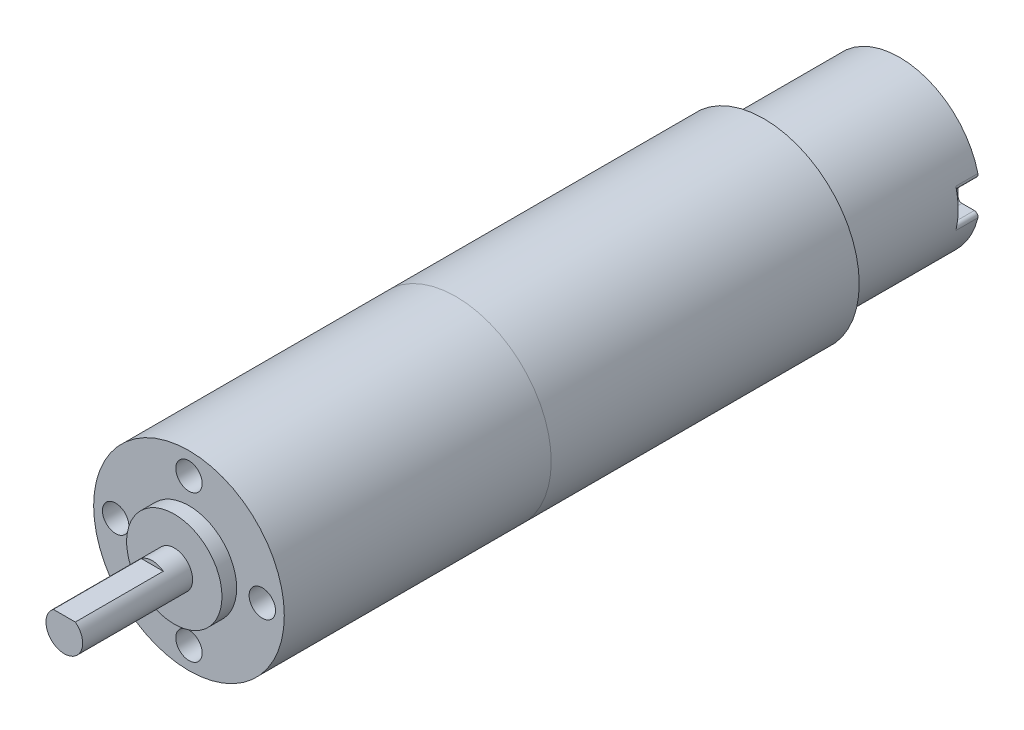
ISO-10303-21;
HEADER;
FILE_DESCRIPTION(('STEP AP214'),'2;1');
FILE_NAME('part.step','',(''),(''),'','','');
FILE_SCHEMA(('AUTOMOTIVE_DESIGN { 1 0 10303 214 1 1 1 1 }'));
ENDSEC;
DATA;
#1=APPLICATION_CONTEXT('core data for automotive mechanical design processes');
#2=APPLICATION_PROTOCOL_DEFINITION('international standard','automotive_design',2000,#1);
#3=PRODUCT_CONTEXT('',#1,'mechanical');
#4=PRODUCT('Part','Part','',(#3));
#5=PRODUCT_RELATED_PRODUCT_CATEGORY('part','',(#4));
#6=PRODUCT_DEFINITION_FORMATION('','',#4);
#7=PRODUCT_DEFINITION_CONTEXT('part definition',#1,'design');
#8=PRODUCT_DEFINITION('design','',#6,#7);
#9=PRODUCT_DEFINITION_SHAPE('','',#8);
#10=(LENGTH_UNIT() NAMED_UNIT(*) SI_UNIT(.MILLI.,.METRE.));
#11=(NAMED_UNIT(*) PLANE_ANGLE_UNIT() SI_UNIT($,.RADIAN.));
#12=(NAMED_UNIT(*) SI_UNIT($,.STERADIAN.) SOLID_ANGLE_UNIT());
#13=UNCERTAINTY_MEASURE_WITH_UNIT(LENGTH_MEASURE(1.E-05),#10,'distance_accuracy_value','');
#14=(GEOMETRIC_REPRESENTATION_CONTEXT(3) GLOBAL_UNCERTAINTY_ASSIGNED_CONTEXT((#13)) GLOBAL_UNIT_ASSIGNED_CONTEXT((#10,
#11,#12)) REPRESENTATION_CONTEXT('',''));
#15=CARTESIAN_POINT('',(0.,0.,0.));
#16=DIRECTION('',(0.,0.,1.));
#17=DIRECTION('',(1.,0.,0.));
#18=AXIS2_PLACEMENT_3D('',#15,#16,#17);
#19=CARTESIAN_POINT('',(0.,0.,-60.5));
#20=DIRECTION('',(0.,0.,1.));
#21=DIRECTION('',(1.,0.,0.));
#22=AXIS2_PLACEMENT_3D('',#19,#20,#21);
#23=CYLINDRICAL_SURFACE('',#22,11.);
#24=CARTESIAN_POINT('',(0.,0.,-56.5));
#25=DIRECTION('',(0.,0.,-1.));
#26=DIRECTION('',(-1.,0.,0.));
#27=AXIS2_PLACEMENT_3D('',#24,#25,#26);
#28=CIRCLE('',#27,11.);
#29=CARTESIAN_POINT('',(7.69839633446142,-7.85714285714285,-56.5));
#30=VERTEX_POINT('',#29);
#31=CARTESIAN_POINT('',(-7.69839633446141,-7.85714285714286,-56.5));
#32=VERTEX_POINT('',#31);
#33=EDGE_CURVE('E320',#30,#32,#28,.T.);
#34=ORIENTED_EDGE('',*,*,#33,.F.);
#35=DIRECTION('',(0.,0.,1.));
#36=VECTOR('',#35,1.);
#37=CARTESIAN_POINT('',(7.69839633446142,-7.85714285714285,-60.5));
#38=LINE('',#37,#36);
#39=CARTESIAN_POINT('',(7.69839633446142,-7.85714285714285,-60.5));
#40=VERTEX_POINT('',#39);
#41=EDGE_CURVE('E223',#30,#40,#38,.F.);
#42=ORIENTED_EDGE('',*,*,#41,.T.);
#43=CARTESIAN_POINT('',(0.,0.,-60.5));
#44=DIRECTION('',(0.,0.,-1.));
#45=DIRECTION('',(-1.,0.,0.));
#46=AXIS2_PLACEMENT_3D('',#43,#44,#45);
#47=CIRCLE('',#46,11.);
#48=CARTESIAN_POINT('',(10.683659933242,-2.61904761904762,-60.5));
#49=VERTEX_POINT('',#48);
#50=EDGE_CURVE('E220',#49,#40,#47,.T.);
#51=ORIENTED_EDGE('',*,*,#50,.F.);
#52=DIRECTION('',(0.,0.,1.));
#53=VECTOR('',#52,1.);
#54=CARTESIAN_POINT('',(10.683659933242,-2.61904761904762,-60.5));
#55=LINE('',#54,#53);
#56=CARTESIAN_POINT('',(10.683659933242,-2.61904761904762,-57.5));
#57=VERTEX_POINT('',#56);
#58=EDGE_CURVE('E316',#49,#57,#55,.T.);
#59=ORIENTED_EDGE('',*,*,#58,.T.);
#60=CARTESIAN_POINT('',(0.,0.,-57.5));
#61=DIRECTION('',(0.,0.,-1.));
#62=DIRECTION('',(-1.,0.,0.));
#63=AXIS2_PLACEMENT_3D('',#60,#61,#62);
#64=CIRCLE('',#63,11.);
#65=CARTESIAN_POINT('',(10.683659933242,2.61904761904762,-57.5));
#66=VERTEX_POINT('',#65);
#67=EDGE_CURVE('E302',#66,#57,#64,.T.);
#68=ORIENTED_EDGE('',*,*,#67,.F.);
#69=DIRECTION('',(0.,0.,1.));
#70=VECTOR('',#69,1.);
#71=CARTESIAN_POINT('',(10.683659933242,2.61904761904762,-60.5));
#72=LINE('',#71,#70);
#73=CARTESIAN_POINT('',(10.683659933242,2.61904761904762,-60.5));
#74=VERTEX_POINT('',#73);
#75=EDGE_CURVE('E329',#66,#74,#72,.F.);
#76=ORIENTED_EDGE('',*,*,#75,.T.);
#77=CARTESIAN_POINT('',(-10.683659933242,2.61904761904762,-60.5));
#78=VERTEX_POINT('',#77);
#79=EDGE_CURVE('E218',#78,#74,#47,.T.);
#80=ORIENTED_EDGE('',*,*,#79,.F.);
#81=DIRECTION('',(0.,0.,1.));
#82=VECTOR('',#81,1.);
#83=CARTESIAN_POINT('',(-10.683659933242,2.61904761904762,-60.5));
#84=LINE('',#83,#82);
#85=CARTESIAN_POINT('',(-10.683659933242,2.61904761904762,-57.5));
#86=VERTEX_POINT('',#85);
#87=EDGE_CURVE('E224',#78,#86,#84,.T.);
#88=ORIENTED_EDGE('',*,*,#87,.T.);
#89=CARTESIAN_POINT('',(0.,0.,-57.5));
#90=DIRECTION('',(0.,0.,1.));
#91=DIRECTION('',(1.,0.,0.));
#92=AXIS2_PLACEMENT_3D('',#89,#90,#91);
#93=CIRCLE('',#92,11.);
#94=CARTESIAN_POINT('',(-10.683659933242,-2.61904761904762,-57.5));
#95=VERTEX_POINT('',#94);
#96=EDGE_CURVE('E359',#86,#95,#93,.T.);
#97=ORIENTED_EDGE('',*,*,#96,.T.);
#98=DIRECTION('',(0.,0.,1.));
#99=VECTOR('',#98,1.);
#100=CARTESIAN_POINT('',(-10.683659933242,-2.61904761904762,-60.5));
#101=LINE('',#100,#99);
#102=CARTESIAN_POINT('',(-10.683659933242,-2.61904761904762,-60.5));
#103=VERTEX_POINT('',#102);
#104=EDGE_CURVE('E216',#95,#103,#101,.F.);
#105=ORIENTED_EDGE('',*,*,#104,.T.);
#106=CARTESIAN_POINT('',(-7.69839633446141,-7.85714285714286,-60.5));
#107=VERTEX_POINT('',#106);
#108=EDGE_CURVE('E199',#107,#103,#47,.T.);
#109=ORIENTED_EDGE('',*,*,#108,.F.);
#110=DIRECTION('',(0.,0.,1.));
#111=VECTOR('',#110,1.);
#112=CARTESIAN_POINT('',(-7.69839633446141,-7.85714285714286,-60.5));
#113=LINE('',#112,#111);
#114=EDGE_CURVE('E213',#107,#32,#113,.T.);
#115=ORIENTED_EDGE('',*,*,#114,.T.);
#116=EDGE_LOOP('',(#34,#42,#51,#59,#68,#76,#80,#88,#97,#105,#109,#115));
#117=FACE_BOUND('',#116,.T.);
#118=CARTESIAN_POINT('',(0.,0.,-42.));
#119=DIRECTION('',(0.,0.,-1.));
#120=DIRECTION('',(-1.,0.,0.));
#121=AXIS2_PLACEMENT_3D('',#118,#119,#120);
#122=CIRCLE('',#121,11.);
#123=CARTESIAN_POINT('',(-11.,0.,-42.));
#124=VERTEX_POINT('',#123);
#125=EDGE_CURVE('E326',#124,#124,#122,.T.);
#126=ORIENTED_EDGE('',*,*,#125,.T.);
#127=EDGE_LOOP('',(#126));
#128=FACE_BOUND('',#127,.T.);
#129=ADVANCED_FACE('F56',(#117,#128),#23,.T.);
#130=CARTESIAN_POINT('',(0.,0.,-60.5));
#131=DIRECTION('',(0.,0.,-1.));
#132=DIRECTION('',(-1.,0.,0.));
#133=AXIS2_PLACEMENT_3D('',#130,#131,#132);
#134=PLANE('',#133);
#135=ORIENTED_EDGE('',*,*,#50,.T.);
#136=CARTESIAN_POINT('',(7.34846922834954,-7.5,-60.5));
#137=DIRECTION('',(0.,0.,-1.));
#138=DIRECTION('',(-1.,0.,0.));
#139=AXIS2_PLACEMENT_3D('',#136,#137,#138);
#140=CIRCLE('',#139,0.5);
#141=CARTESIAN_POINT('',(7.34846922834954,-8.,-60.5));
#142=VERTEX_POINT('',#141);
#143=EDGE_CURVE('E206',#40,#142,#140,.T.);
#144=ORIENTED_EDGE('',*,*,#143,.T.);
#145=DIRECTION('',(-1.,0.,0.));
#146=VECTOR('',#145,1.);
#147=CARTESIAN_POINT('',(0.,-8.,-60.5));
#148=LINE('',#147,#146);
#149=CARTESIAN_POINT('',(-7.34846922834953,-8.,-60.5));
#150=VERTEX_POINT('',#149);
#151=EDGE_CURVE('E201',#142,#150,#148,.T.);
#152=ORIENTED_EDGE('',*,*,#151,.T.);
#153=CARTESIAN_POINT('',(-7.34846922834953,-7.5,-60.5));
#154=DIRECTION('',(0.,0.,-1.));
#155=DIRECTION('',(-1.,0.,0.));
#156=AXIS2_PLACEMENT_3D('',#153,#154,#155);
#157=CIRCLE('',#156,0.5);
#158=EDGE_CURVE('E195',#150,#107,#157,.T.);
#159=ORIENTED_EDGE('',*,*,#158,.T.);
#160=ORIENTED_EDGE('',*,*,#108,.T.);
#161=CARTESIAN_POINT('',(-10.1980390271856,-2.5,-60.5));
#162=DIRECTION('',(0.,0.,-1.));
#163=DIRECTION('',(-1.,0.,0.));
#164=AXIS2_PLACEMENT_3D('',#161,#162,#163);
#165=CIRCLE('',#164,0.5);
#166=CARTESIAN_POINT('',(-10.1980390271856,-2.,-60.5));
#167=VERTEX_POINT('',#166);
#168=EDGE_CURVE('E236',#103,#167,#165,.T.);
#169=ORIENTED_EDGE('',*,*,#168,.T.);
#170=DIRECTION('',(-1.,0.,0.));
#171=VECTOR('',#170,1.);
#172=CARTESIAN_POINT('',(0.,-2.,-60.5));
#173=LINE('',#172,#171);
#174=CARTESIAN_POINT('',(-8.5,-2.,-60.5));
#175=VERTEX_POINT('',#174);
#176=EDGE_CURVE('E367',#175,#167,#173,.T.);
#177=ORIENTED_EDGE('',*,*,#176,.F.);
#178=CARTESIAN_POINT('',(-8.5,-1.5,-60.5));
#179=DIRECTION('',(0.,0.,-1.));
#180=DIRECTION('',(-1.,0.,0.));
#181=AXIS2_PLACEMENT_3D('',#178,#179,#180);
#182=CIRCLE('',#181,0.5);
#183=CARTESIAN_POINT('',(-8.,-1.5,-60.5));
#184=VERTEX_POINT('',#183);
#185=EDGE_CURVE('E291',#175,#184,#182,.F.);
#186=ORIENTED_EDGE('',*,*,#185,.T.);
#187=DIRECTION('',(0.,-1.,0.));
#188=VECTOR('',#187,1.);
#189=CARTESIAN_POINT('',(-8.,0.,-60.5));
#190=LINE('',#189,#188);
#191=CARTESIAN_POINT('',(-8.,1.5,-60.5));
#192=VERTEX_POINT('',#191);
#193=EDGE_CURVE('E371',#192,#184,#190,.T.);
#194=ORIENTED_EDGE('',*,*,#193,.F.);
#195=CARTESIAN_POINT('',(-8.5,1.5,-60.5));
#196=DIRECTION('',(0.,0.,-1.));
#197=DIRECTION('',(-1.,0.,0.));
#198=AXIS2_PLACEMENT_3D('',#195,#196,#197);
#199=CIRCLE('',#198,0.5);
#200=CARTESIAN_POINT('',(-8.5,2.,-60.5));
#201=VERTEX_POINT('',#200);
#202=EDGE_CURVE('E289',#192,#201,#199,.F.);
#203=ORIENTED_EDGE('',*,*,#202,.T.);
#204=DIRECTION('',(-1.,0.,0.));
#205=VECTOR('',#204,1.);
#206=CARTESIAN_POINT('',(0.,2.,-60.5));
#207=LINE('',#206,#205);
#208=CARTESIAN_POINT('',(-10.1980390271856,2.,-60.5));
#209=VERTEX_POINT('',#208);
#210=EDGE_CURVE('E345',#201,#209,#207,.T.);
#211=ORIENTED_EDGE('',*,*,#210,.T.);
#212=CARTESIAN_POINT('',(-10.1980390271856,2.5,-60.5));
#213=DIRECTION('',(0.,0.,-1.));
#214=DIRECTION('',(-1.,0.,0.));
#215=AXIS2_PLACEMENT_3D('',#212,#213,#214);
#216=CIRCLE('',#215,0.5);
#217=EDGE_CURVE('E207',#209,#78,#216,.T.);
#218=ORIENTED_EDGE('',*,*,#217,.T.);
#219=ORIENTED_EDGE('',*,*,#79,.T.);
#220=CARTESIAN_POINT('',(10.1980390271856,2.5,-60.5));
#221=DIRECTION('',(0.,0.,-1.));
#222=DIRECTION('',(-1.,0.,0.));
#223=AXIS2_PLACEMENT_3D('',#220,#221,#222);
#224=CIRCLE('',#223,0.5);
#225=CARTESIAN_POINT('',(10.1980390271856,2.,-60.5));
#226=VERTEX_POINT('',#225);
#227=EDGE_CURVE('E227',#74,#226,#224,.T.);
#228=ORIENTED_EDGE('',*,*,#227,.T.);
#229=DIRECTION('',(1.,0.,0.));
#230=VECTOR('',#229,1.);
#231=CARTESIAN_POINT('',(0.,2.,-60.5));
#232=LINE('',#231,#230);
#233=CARTESIAN_POINT('',(8.5,2.,-60.5));
#234=VERTEX_POINT('',#233);
#235=EDGE_CURVE('E313',#234,#226,#232,.T.);
#236=ORIENTED_EDGE('',*,*,#235,.F.);
#237=CARTESIAN_POINT('',(8.5,1.5,-60.5));
#238=DIRECTION('',(0.,0.,-1.));
#239=DIRECTION('',(-1.,0.,0.));
#240=AXIS2_PLACEMENT_3D('',#237,#238,#239);
#241=CIRCLE('',#240,0.5);
#242=CARTESIAN_POINT('',(8.,1.5,-60.5));
#243=VERTEX_POINT('',#242);
#244=EDGE_CURVE('E295',#234,#243,#241,.F.);
#245=ORIENTED_EDGE('',*,*,#244,.T.);
#246=DIRECTION('',(0.,-1.,0.));
#247=VECTOR('',#246,1.);
#248=CARTESIAN_POINT('',(8.,0.,-60.5));
#249=LINE('',#248,#247);
#250=CARTESIAN_POINT('',(8.,-1.5,-60.5));
#251=VERTEX_POINT('',#250);
#252=EDGE_CURVE('E380',#243,#251,#249,.T.);
#253=ORIENTED_EDGE('',*,*,#252,.T.);
#254=CARTESIAN_POINT('',(8.5,-1.5,-60.5));
#255=DIRECTION('',(0.,0.,-1.));
#256=DIRECTION('',(-1.,0.,0.));
#257=AXIS2_PLACEMENT_3D('',#254,#255,#256);
#258=CIRCLE('',#257,0.5);
#259=CARTESIAN_POINT('',(8.5,-2.,-60.5));
#260=VERTEX_POINT('',#259);
#261=EDGE_CURVE('E293',#251,#260,#258,.F.);
#262=ORIENTED_EDGE('',*,*,#261,.T.);
#263=DIRECTION('',(1.,0.,0.));
#264=VECTOR('',#263,1.);
#265=CARTESIAN_POINT('',(0.,-2.,-60.5));
#266=LINE('',#265,#264);
#267=CARTESIAN_POINT('',(10.1980390271856,-2.,-60.5));
#268=VERTEX_POINT('',#267);
#269=EDGE_CURVE('E318',#260,#268,#266,.T.);
#270=ORIENTED_EDGE('',*,*,#269,.T.);
#271=CARTESIAN_POINT('',(10.1980390271856,-2.5,-60.5));
#272=DIRECTION('',(0.,0.,-1.));
#273=DIRECTION('',(-1.,0.,0.));
#274=AXIS2_PLACEMENT_3D('',#271,#272,#273);
#275=CIRCLE('',#274,0.5);
#276=EDGE_CURVE('E234',#268,#49,#275,.T.);
#277=ORIENTED_EDGE('',*,*,#276,.T.);
#278=EDGE_LOOP('',(#135,#144,#152,#159,#160,#169,#177,#186,#194,#203,#211,#218,#219,#228,#236,
#245,#253,#262,#270,#277));
#279=FACE_BOUND('',#278,.T.);
#280=ADVANCED_FACE('F198',(#279),#134,.T.);
#281=CARTESIAN_POINT('',(0.,0.,-42.));
#282=DIRECTION('',(0.,0.,1.));
#283=DIRECTION('',(1.,0.,0.));
#284=AXIS2_PLACEMENT_3D('',#281,#282,#283);
#285=CYLINDRICAL_SURFACE('',#284,13.);
#286=CARTESIAN_POINT('',(0.,0.,-42.));
#287=DIRECTION('',(0.,0.,-1.));
#288=DIRECTION('',(-1.,0.,0.));
#289=AXIS2_PLACEMENT_3D('',#286,#287,#288);
#290=CIRCLE('',#289,13.);
#291=CARTESIAN_POINT('',(-13.,0.,-42.));
#292=VERTEX_POINT('',#291);
#293=EDGE_CURVE('E330',#292,#292,#290,.T.);
#294=ORIENTED_EDGE('',*,*,#293,.F.);
#295=EDGE_LOOP('',(#294));
#296=FACE_BOUND('',#295,.T.);
#297=CARTESIAN_POINT('',(0.,0.,0.));
#298=DIRECTION('',(0.,0.,-1.));
#299=DIRECTION('',(-1.,0.,0.));
#300=AXIS2_PLACEMENT_3D('',#297,#298,#299);
#301=CIRCLE('',#300,13.);
#302=CARTESIAN_POINT('',(-13.,0.,0.));
#303=VERTEX_POINT('',#302);
#304=EDGE_CURVE('E217',#303,#303,#301,.T.);
#305=ORIENTED_EDGE('',*,*,#304,.T.);
#306=EDGE_LOOP('',(#305));
#307=FACE_BOUND('',#306,.T.);
#308=ADVANCED_FACE('F409',(#296,#307),#285,.T.);
#309=CARTESIAN_POINT('',(0.,0.,-42.));
#310=DIRECTION('',(0.,0.,-1.));
#311=DIRECTION('',(-1.,0.,0.));
#312=AXIS2_PLACEMENT_3D('',#309,#310,#311);
#313=PLANE('',#312);
#314=ORIENTED_EDGE('',*,*,#125,.F.);
#315=EDGE_LOOP('',(#314));
#316=FACE_BOUND('',#315,.T.);
#317=ORIENTED_EDGE('',*,*,#293,.T.);
#318=EDGE_LOOP('',(#317));
#319=FACE_BOUND('',#318,.T.);
#320=ADVANCED_FACE('F413',(#316,#319),#313,.T.);
#321=CARTESIAN_POINT('',(0.,0.,0.));
#322=DIRECTION('',(0.,0.,-1.));
#323=DIRECTION('',(-1.,0.,0.));
#324=AXIS2_PLACEMENT_3D('',#321,#322,#323);
#325=PLANE('',#324);
#326=ORIENTED_EDGE('',*,*,#304,.F.);
#327=EDGE_LOOP('',(#326));
#328=FACE_BOUND('',#327,.T.);
#329=ADVANCED_FACE('F416',(#328),#325,.F.);
#330=CARTESIAN_POINT('',(0.,-8.,-56.5));
#331=DIRECTION('',(0.,-1.,0.));
#332=DIRECTION('',(1.,0.,0.));
#333=AXIS2_PLACEMENT_3D('',#330,#331,#332);
#334=PLANE('',#333);
#335=ORIENTED_EDGE('',*,*,#151,.F.);
#336=DIRECTION('',(0.,0.,-1.));
#337=VECTOR('',#336,1.);
#338=CARTESIAN_POINT('',(7.34846922834954,-8.,-56.5));
#339=LINE('',#338,#337);
#340=CARTESIAN_POINT('',(7.34846922834954,-8.,-56.5));
#341=VERTEX_POINT('',#340);
#342=EDGE_CURVE('E242',#142,#341,#339,.F.);
#343=ORIENTED_EDGE('',*,*,#342,.T.);
#344=DIRECTION('',(-1.,0.,0.));
#345=VECTOR('',#344,1.);
#346=CARTESIAN_POINT('',(0.,-8.,-56.5));
#347=LINE('',#346,#345);
#348=CARTESIAN_POINT('',(-7.34846922834953,-8.,-56.5));
#349=VERTEX_POINT('',#348);
#350=EDGE_CURVE('E322',#341,#349,#347,.T.);
#351=ORIENTED_EDGE('',*,*,#350,.T.);
#352=DIRECTION('',(0.,0.,-1.));
#353=VECTOR('',#352,1.);
#354=CARTESIAN_POINT('',(-7.34846922834953,-8.,-60.5));
#355=LINE('',#354,#353);
#356=EDGE_CURVE('E240',#349,#150,#355,.T.);
#357=ORIENTED_EDGE('',*,*,#356,.T.);
#358=EDGE_LOOP('',(#335,#343,#351,#357));
#359=FACE_BOUND('',#358,.T.);
#360=ADVANCED_FACE('F387',(#359),#334,.T.);
#361=CARTESIAN_POINT('',(0.,0.,-56.5));
#362=DIRECTION('',(0.,0.,-1.));
#363=DIRECTION('',(-1.,0.,0.));
#364=AXIS2_PLACEMENT_3D('',#361,#362,#363);
#365=PLANE('',#364);
#366=ORIENTED_EDGE('',*,*,#350,.F.);
#367=CARTESIAN_POINT('',(7.34846922834954,-7.5,-56.5));
#368=DIRECTION('',(0.,0.,-1.));
#369=DIRECTION('',(-1.,0.,0.));
#370=AXIS2_PLACEMENT_3D('',#367,#368,#369);
#371=CIRCLE('',#370,0.5);
#372=EDGE_CURVE('E280',#341,#30,#371,.F.);
#373=ORIENTED_EDGE('',*,*,#372,.T.);
#374=ORIENTED_EDGE('',*,*,#33,.T.);
#375=CARTESIAN_POINT('',(-7.34846922834953,-7.5,-56.5));
#376=DIRECTION('',(0.,0.,-1.));
#377=DIRECTION('',(-1.,0.,0.));
#378=AXIS2_PLACEMENT_3D('',#375,#376,#377);
#379=CIRCLE('',#378,0.5);
#380=EDGE_CURVE('E222',#32,#349,#379,.F.);
#381=ORIENTED_EDGE('',*,*,#380,.T.);
#382=EDGE_LOOP('',(#366,#373,#374,#381));
#383=FACE_BOUND('',#382,.T.);
#384=ADVANCED_FACE('F391',(#383),#365,.T.);
#385=CARTESIAN_POINT('',(0.,-2.,-57.5));
#386=DIRECTION('',(0.,1.,0.));
#387=DIRECTION('',(0.,0.,1.));
#388=AXIS2_PLACEMENT_3D('',#385,#386,#387);
#389=PLANE('',#388);
#390=ORIENTED_EDGE('',*,*,#269,.F.);
#391=DIRECTION('',(0.,0.,-1.));
#392=VECTOR('',#391,1.);
#393=CARTESIAN_POINT('',(8.5,-2.,-57.5));
#394=LINE('',#393,#392);
#395=CARTESIAN_POINT('',(8.5,-2.,-57.5));
#396=VERTEX_POINT('',#395);
#397=EDGE_CURVE('E271',#260,#396,#394,.F.);
#398=ORIENTED_EDGE('',*,*,#397,.T.);
#399=DIRECTION('',(1.,0.,0.));
#400=VECTOR('',#399,1.);
#401=CARTESIAN_POINT('',(0.,-2.,-57.5));
#402=LINE('',#401,#400);
#403=CARTESIAN_POINT('',(10.1980390271856,-2.,-57.5));
#404=VERTEX_POINT('',#403);
#405=EDGE_CURVE('E300',#396,#404,#402,.T.);
#406=ORIENTED_EDGE('',*,*,#405,.T.);
#407=DIRECTION('',(0.,0.,-1.));
#408=VECTOR('',#407,1.);
#409=CARTESIAN_POINT('',(10.1980390271856,-2.,-60.5));
#410=LINE('',#409,#408);
#411=EDGE_CURVE('E268',#404,#268,#410,.T.);
#412=ORIENTED_EDGE('',*,*,#411,.T.);
#413=EDGE_LOOP('',(#390,#398,#406,#412));
#414=FACE_BOUND('',#413,.T.);
#415=ADVANCED_FACE('F309',(#414),#389,.T.);
#416=CARTESIAN_POINT('',(0.,2.,-57.5));
#417=DIRECTION('',(0.,1.,0.));
#418=DIRECTION('',(0.,0.,1.));
#419=AXIS2_PLACEMENT_3D('',#416,#417,#418);
#420=PLANE('',#419);
#421=DIRECTION('',(1.,0.,0.));
#422=VECTOR('',#421,1.);
#423=CARTESIAN_POINT('',(0.,2.,-57.5));
#424=LINE('',#423,#422);
#425=CARTESIAN_POINT('',(8.5,2.,-57.5));
#426=VERTEX_POINT('',#425);
#427=CARTESIAN_POINT('',(10.1980390271856,2.,-57.5));
#428=VERTEX_POINT('',#427);
#429=EDGE_CURVE('E376',#426,#428,#424,.T.);
#430=ORIENTED_EDGE('',*,*,#429,.F.);
#431=DIRECTION('',(0.,0.,-1.));
#432=VECTOR('',#431,1.);
#433=CARTESIAN_POINT('',(8.5,2.,-57.5));
#434=LINE('',#433,#432);
#435=EDGE_CURVE('E277',#426,#234,#434,.T.);
#436=ORIENTED_EDGE('',*,*,#435,.T.);
#437=ORIENTED_EDGE('',*,*,#235,.T.);
#438=DIRECTION('',(0.,0.,1.));
#439=VECTOR('',#438,1.);
#440=CARTESIAN_POINT('',(10.1980390271856,2.,-57.5));
#441=LINE('',#440,#439);
#442=EDGE_CURVE('E71',#226,#428,#441,.T.);
#443=ORIENTED_EDGE('',*,*,#442,.T.);
#444=EDGE_LOOP('',(#430,#436,#437,#443));
#445=FACE_BOUND('',#444,.T.);
#446=ADVANCED_FACE('F482',(#445),#420,.F.);
#447=CARTESIAN_POINT('',(8.,0.,-57.5));
#448=DIRECTION('',(1.,0.,0.));
#449=DIRECTION('',(0.,0.,-1.));
#450=AXIS2_PLACEMENT_3D('',#447,#448,#449);
#451=PLANE('',#450);
#452=DIRECTION('',(0.,-1.,0.));
#453=VECTOR('',#452,1.);
#454=CARTESIAN_POINT('',(8.,0.,-57.5));
#455=LINE('',#454,#453);
#456=CARTESIAN_POINT('',(8.,1.5,-57.5));
#457=VERTEX_POINT('',#456);
#458=CARTESIAN_POINT('',(8.,-1.5,-57.5));
#459=VERTEX_POINT('',#458);
#460=EDGE_CURVE('E312',#457,#459,#455,.T.);
#461=ORIENTED_EDGE('',*,*,#460,.T.);
#462=DIRECTION('',(0.,0.,-1.));
#463=VECTOR('',#462,1.);
#464=CARTESIAN_POINT('',(8.,-1.5,-60.5));
#465=LINE('',#464,#463);
#466=EDGE_CURVE('E265',#459,#251,#465,.T.);
#467=ORIENTED_EDGE('',*,*,#466,.T.);
#468=ORIENTED_EDGE('',*,*,#252,.F.);
#469=DIRECTION('',(0.,0.,-1.));
#470=VECTOR('',#469,1.);
#471=CARTESIAN_POINT('',(8.,1.5,-57.5));
#472=LINE('',#471,#470);
#473=EDGE_CURVE('E263',#243,#457,#472,.F.);
#474=ORIENTED_EDGE('',*,*,#473,.T.);
#475=EDGE_LOOP('',(#461,#467,#468,#474));
#476=FACE_BOUND('',#475,.T.);
#477=ADVANCED_FACE('F494',(#476),#451,.T.);
#478=CARTESIAN_POINT('',(0.,0.,-57.5));
#479=DIRECTION('',(0.,0.,-1.));
#480=DIRECTION('',(-1.,0.,0.));
#481=AXIS2_PLACEMENT_3D('',#478,#479,#480);
#482=PLANE('',#481);
#483=ORIENTED_EDGE('',*,*,#405,.F.);
#484=CARTESIAN_POINT('',(8.5,-1.5,-57.5));
#485=DIRECTION('',(0.,0.,-1.));
#486=DIRECTION('',(-1.,0.,0.));
#487=AXIS2_PLACEMENT_3D('',#484,#485,#486);
#488=CIRCLE('',#487,0.5);
#489=EDGE_CURVE('E274',#396,#459,#488,.T.);
#490=ORIENTED_EDGE('',*,*,#489,.T.);
#491=ORIENTED_EDGE('',*,*,#460,.F.);
#492=CARTESIAN_POINT('',(8.5,1.5,-57.5));
#493=DIRECTION('',(0.,0.,-1.));
#494=DIRECTION('',(-1.,0.,0.));
#495=AXIS2_PLACEMENT_3D('',#492,#493,#494);
#496=CIRCLE('',#495,0.5);
#497=EDGE_CURVE('E78',#457,#426,#496,.T.);
#498=ORIENTED_EDGE('',*,*,#497,.T.);
#499=ORIENTED_EDGE('',*,*,#429,.T.);
#500=CARTESIAN_POINT('',(10.1980390271856,2.5,-57.5));
#501=DIRECTION('',(0.,0.,-1.));
#502=DIRECTION('',(-1.,0.,0.));
#503=AXIS2_PLACEMENT_3D('',#500,#501,#502);
#504=CIRCLE('',#503,0.5);
#505=EDGE_CURVE('E12',#428,#66,#504,.F.);
#506=ORIENTED_EDGE('',*,*,#505,.T.);
#507=ORIENTED_EDGE('',*,*,#67,.T.);
#508=CARTESIAN_POINT('',(10.1980390271856,-2.5,-57.5));
#509=DIRECTION('',(0.,0.,-1.));
#510=DIRECTION('',(-1.,0.,0.));
#511=AXIS2_PLACEMENT_3D('',#508,#509,#510);
#512=CIRCLE('',#511,0.5);
#513=EDGE_CURVE('E64',#57,#404,#512,.F.);
#514=ORIENTED_EDGE('',*,*,#513,.T.);
#515=EDGE_LOOP('',(#483,#490,#491,#498,#499,#506,#507,#514));
#516=FACE_BOUND('',#515,.T.);
#517=ADVANCED_FACE('F299',(#516),#482,.T.);
#518=CARTESIAN_POINT('',(0.,-2.,-57.5));
#519=DIRECTION('',(0.,-1.,0.));
#520=DIRECTION('',(0.,0.,-1.));
#521=AXIS2_PLACEMENT_3D('',#518,#519,#520);
#522=PLANE('',#521);
#523=ORIENTED_EDGE('',*,*,#176,.T.);
#524=DIRECTION('',(0.,0.,1.));
#525=VECTOR('',#524,1.);
#526=CARTESIAN_POINT('',(-10.1980390271856,-2.,-57.5));
#527=LINE('',#526,#525);
#528=CARTESIAN_POINT('',(-10.1980390271856,-2.,-57.5));
#529=VERTEX_POINT('',#528);
#530=EDGE_CURVE('E252',#167,#529,#527,.T.);
#531=ORIENTED_EDGE('',*,*,#530,.T.);
#532=DIRECTION('',(-1.,0.,0.));
#533=VECTOR('',#532,1.);
#534=CARTESIAN_POINT('',(0.,-2.,-57.5));
#535=LINE('',#534,#533);
#536=CARTESIAN_POINT('',(-8.5,-2.,-57.5));
#537=VERTEX_POINT('',#536);
#538=EDGE_CURVE('E363',#537,#529,#535,.T.);
#539=ORIENTED_EDGE('',*,*,#538,.F.);
#540=DIRECTION('',(0.,0.,-1.));
#541=VECTOR('',#540,1.);
#542=CARTESIAN_POINT('',(-8.5,-2.,-60.5));
#543=LINE('',#542,#541);
#544=EDGE_CURVE('E249',#537,#175,#543,.T.);
#545=ORIENTED_EDGE('',*,*,#544,.T.);
#546=EDGE_LOOP('',(#523,#531,#539,#545));
#547=FACE_BOUND('',#546,.T.);
#548=ADVANCED_FACE('F518',(#547),#522,.F.);
#549=CARTESIAN_POINT('',(-8.,0.,-57.5));
#550=DIRECTION('',(1.,0.,0.));
#551=DIRECTION('',(0.,0.,-1.));
#552=AXIS2_PLACEMENT_3D('',#549,#550,#551);
#553=PLANE('',#552);
#554=DIRECTION('',(0.,-1.,0.));
#555=VECTOR('',#554,1.);
#556=CARTESIAN_POINT('',(-8.,0.,-57.5));
#557=LINE('',#556,#555);
#558=CARTESIAN_POINT('',(-8.,1.5,-57.5));
#559=VERTEX_POINT('',#558);
#560=CARTESIAN_POINT('',(-8.,-1.5,-57.5));
#561=VERTEX_POINT('',#560);
#562=EDGE_CURVE('E358',#559,#561,#557,.T.);
#563=ORIENTED_EDGE('',*,*,#562,.F.);
#564=DIRECTION('',(0.,0.,-1.));
#565=VECTOR('',#564,1.);
#566=CARTESIAN_POINT('',(-8.,1.5,-57.5));
#567=LINE('',#566,#565);
#568=EDGE_CURVE('E256',#559,#192,#567,.T.);
#569=ORIENTED_EDGE('',*,*,#568,.T.);
#570=ORIENTED_EDGE('',*,*,#193,.T.);
#571=DIRECTION('',(0.,0.,-1.));
#572=VECTOR('',#571,1.);
#573=CARTESIAN_POINT('',(-8.,-1.5,-57.5));
#574=LINE('',#573,#572);
#575=EDGE_CURVE('E254',#184,#561,#574,.F.);
#576=ORIENTED_EDGE('',*,*,#575,.T.);
#577=EDGE_LOOP('',(#563,#569,#570,#576));
#578=FACE_BOUND('',#577,.T.);
#579=ADVANCED_FACE('F529',(#578),#553,.F.);
#580=CARTESIAN_POINT('',(0.,2.,-57.5));
#581=DIRECTION('',(0.,-1.,0.));
#582=DIRECTION('',(0.,0.,-1.));
#583=AXIS2_PLACEMENT_3D('',#580,#581,#582);
#584=PLANE('',#583);
#585=DIRECTION('',(-1.,0.,0.));
#586=VECTOR('',#585,1.);
#587=CARTESIAN_POINT('',(0.,2.,-57.5));
#588=LINE('',#587,#586);
#589=CARTESIAN_POINT('',(-8.5,2.,-57.5));
#590=VERTEX_POINT('',#589);
#591=CARTESIAN_POINT('',(-10.1980390271856,2.,-57.5));
#592=VERTEX_POINT('',#591);
#593=EDGE_CURVE('E355',#590,#592,#588,.T.);
#594=ORIENTED_EDGE('',*,*,#593,.T.);
#595=DIRECTION('',(0.,0.,-1.));
#596=VECTOR('',#595,1.);
#597=CARTESIAN_POINT('',(-10.1980390271856,2.,-60.5));
#598=LINE('',#597,#596);
#599=EDGE_CURVE('E246',#592,#209,#598,.T.);
#600=ORIENTED_EDGE('',*,*,#599,.T.);
#601=ORIENTED_EDGE('',*,*,#210,.F.);
#602=DIRECTION('',(0.,0.,-1.));
#603=VECTOR('',#602,1.);
#604=CARTESIAN_POINT('',(-8.5,2.,-57.5));
#605=LINE('',#604,#603);
#606=EDGE_CURVE('E244',#201,#590,#605,.F.);
#607=ORIENTED_EDGE('',*,*,#606,.T.);
#608=EDGE_LOOP('',(#594,#600,#601,#607));
#609=FACE_BOUND('',#608,.T.);
#610=ADVANCED_FACE('F352',(#609),#584,.T.);
#611=CARTESIAN_POINT('',(0.,0.,-57.5));
#612=DIRECTION('',(0.,0.,-1.));
#613=DIRECTION('',(1.,0.,0.));
#614=AXIS2_PLACEMENT_3D('',#611,#612,#613);
#615=PLANE('',#614);
#616=ORIENTED_EDGE('',*,*,#593,.F.);
#617=CARTESIAN_POINT('',(-8.5,1.5,-57.5));
#618=DIRECTION('',(0.,0.,-1.));
#619=DIRECTION('',(-1.,0.,0.));
#620=AXIS2_PLACEMENT_3D('',#617,#618,#619);
#621=CIRCLE('',#620,0.5);
#622=EDGE_CURVE('E261',#590,#559,#621,.T.);
#623=ORIENTED_EDGE('',*,*,#622,.T.);
#624=ORIENTED_EDGE('',*,*,#562,.T.);
#625=CARTESIAN_POINT('',(-8.5,-1.5,-57.5));
#626=DIRECTION('',(0.,0.,-1.));
#627=DIRECTION('',(-1.,0.,0.));
#628=AXIS2_PLACEMENT_3D('',#625,#626,#627);
#629=CIRCLE('',#628,0.5);
#630=EDGE_CURVE('E259',#561,#537,#629,.T.);
#631=ORIENTED_EDGE('',*,*,#630,.T.);
#632=ORIENTED_EDGE('',*,*,#538,.T.);
#633=CARTESIAN_POINT('',(-10.1980390271856,-2.5,-57.5));
#634=DIRECTION('',(0.,0.,-1.));
#635=DIRECTION('',(-1.,0.,0.));
#636=AXIS2_PLACEMENT_3D('',#633,#634,#635);
#637=CIRCLE('',#636,0.5);
#638=EDGE_CURVE('E286',#529,#95,#637,.F.);
#639=ORIENTED_EDGE('',*,*,#638,.T.);
#640=ORIENTED_EDGE('',*,*,#96,.F.);
#641=CARTESIAN_POINT('',(-10.1980390271856,2.5,-57.5));
#642=DIRECTION('',(0.,0.,-1.));
#643=DIRECTION('',(-1.,0.,0.));
#644=AXIS2_PLACEMENT_3D('',#641,#642,#643);
#645=CIRCLE('',#644,0.5);
#646=EDGE_CURVE('E284',#86,#592,#645,.F.);
#647=ORIENTED_EDGE('',*,*,#646,.T.);
#648=EDGE_LOOP('',(#616,#623,#624,#631,#632,#639,#640,#647));
#649=FACE_BOUND('',#648,.T.);
#650=ADVANCED_FACE('F395',(#649),#615,.T.);
#651=CARTESIAN_POINT('',(7.34846922834954,-7.5,-60.5));
#652=DIRECTION('',(0.,0.,1.));
#653=DIRECTION('',(1.,0.,0.));
#654=AXIS2_PLACEMENT_3D('',#651,#652,#653);
#655=CYLINDRICAL_SURFACE('',#654,0.5);
#656=ORIENTED_EDGE('',*,*,#372,.F.);
#657=ORIENTED_EDGE('',*,*,#342,.F.);
#658=ORIENTED_EDGE('',*,*,#143,.F.);
#659=ORIENTED_EDGE('',*,*,#41,.F.);
#660=EDGE_LOOP('',(#656,#657,#658,#659));
#661=FACE_BOUND('',#660,.T.);
#662=ADVANCED_FACE('F393',(#661),#655,.T.);
#663=CARTESIAN_POINT('',(-7.34846922834953,-7.5,-60.5));
#664=DIRECTION('',(0.,0.,1.));
#665=DIRECTION('',(1.,0.,0.));
#666=AXIS2_PLACEMENT_3D('',#663,#664,#665);
#667=CYLINDRICAL_SURFACE('',#666,0.5);
#668=ORIENTED_EDGE('',*,*,#380,.F.);
#669=ORIENTED_EDGE('',*,*,#114,.F.);
#670=ORIENTED_EDGE('',*,*,#158,.F.);
#671=ORIENTED_EDGE('',*,*,#356,.F.);
#672=EDGE_LOOP('',(#668,#669,#670,#671));
#673=FACE_BOUND('',#672,.T.);
#674=ADVANCED_FACE('F221',(#673),#667,.T.);
#675=CARTESIAN_POINT('',(-10.1980390271856,2.5,-60.5));
#676=DIRECTION('',(0.,0.,1.));
#677=DIRECTION('',(1.,0.,0.));
#678=AXIS2_PLACEMENT_3D('',#675,#676,#677);
#679=CYLINDRICAL_SURFACE('',#678,0.5);
#680=ORIENTED_EDGE('',*,*,#646,.F.);
#681=ORIENTED_EDGE('',*,*,#87,.F.);
#682=ORIENTED_EDGE('',*,*,#217,.F.);
#683=ORIENTED_EDGE('',*,*,#599,.F.);
#684=EDGE_LOOP('',(#680,#681,#682,#683));
#685=FACE_BOUND('',#684,.T.);
#686=ADVANCED_FACE('F349',(#685),#679,.T.);
#687=CARTESIAN_POINT('',(-10.1980390271856,-2.5,-60.5));
#688=DIRECTION('',(0.,0.,1.));
#689=DIRECTION('',(1.,0.,0.));
#690=AXIS2_PLACEMENT_3D('',#687,#688,#689);
#691=CYLINDRICAL_SURFACE('',#690,0.5);
#692=ORIENTED_EDGE('',*,*,#638,.F.);
#693=ORIENTED_EDGE('',*,*,#530,.F.);
#694=ORIENTED_EDGE('',*,*,#168,.F.);
#695=ORIENTED_EDGE('',*,*,#104,.F.);
#696=EDGE_LOOP('',(#692,#693,#694,#695));
#697=FACE_BOUND('',#696,.T.);
#698=ADVANCED_FACE('F587',(#697),#691,.T.);
#699=CARTESIAN_POINT('',(-8.5,1.5,-57.5));
#700=DIRECTION('',(0.,0.,-1.));
#701=DIRECTION('',(-1.,0.,0.));
#702=AXIS2_PLACEMENT_3D('',#699,#700,#701);
#703=CYLINDRICAL_SURFACE('',#702,0.5);
#704=ORIENTED_EDGE('',*,*,#622,.F.);
#705=ORIENTED_EDGE('',*,*,#606,.F.);
#706=ORIENTED_EDGE('',*,*,#202,.F.);
#707=ORIENTED_EDGE('',*,*,#568,.F.);
#708=EDGE_LOOP('',(#704,#705,#706,#707));
#709=FACE_BOUND('',#708,.T.);
#710=ADVANCED_FACE('F597',(#709),#703,.F.);
#711=CARTESIAN_POINT('',(-8.5,-1.5,-57.5));
#712=DIRECTION('',(0.,0.,1.));
#713=DIRECTION('',(1.,0.,0.));
#714=AXIS2_PLACEMENT_3D('',#711,#712,#713);
#715=CYLINDRICAL_SURFACE('',#714,0.5);
#716=ORIENTED_EDGE('',*,*,#630,.F.);
#717=ORIENTED_EDGE('',*,*,#575,.F.);
#718=ORIENTED_EDGE('',*,*,#185,.F.);
#719=ORIENTED_EDGE('',*,*,#544,.F.);
#720=EDGE_LOOP('',(#716,#717,#718,#719));
#721=FACE_BOUND('',#720,.T.);
#722=ADVANCED_FACE('F608',(#721),#715,.F.);
#723=CARTESIAN_POINT('',(8.5,-1.5,-57.5));
#724=DIRECTION('',(0.,0.,1.));
#725=DIRECTION('',(1.,0.,0.));
#726=AXIS2_PLACEMENT_3D('',#723,#724,#725);
#727=CYLINDRICAL_SURFACE('',#726,0.5);
#728=ORIENTED_EDGE('',*,*,#489,.F.);
#729=ORIENTED_EDGE('',*,*,#397,.F.);
#730=ORIENTED_EDGE('',*,*,#261,.F.);
#731=ORIENTED_EDGE('',*,*,#466,.F.);
#732=EDGE_LOOP('',(#728,#729,#730,#731));
#733=FACE_BOUND('',#732,.T.);
#734=ADVANCED_FACE('F619',(#733),#727,.F.);
#735=CARTESIAN_POINT('',(8.5,1.5,-57.5));
#736=DIRECTION('',(0.,0.,-1.));
#737=DIRECTION('',(-1.,0.,0.));
#738=AXIS2_PLACEMENT_3D('',#735,#736,#737);
#739=CYLINDRICAL_SURFACE('',#738,0.5);
#740=ORIENTED_EDGE('',*,*,#497,.F.);
#741=ORIENTED_EDGE('',*,*,#473,.F.);
#742=ORIENTED_EDGE('',*,*,#244,.F.);
#743=ORIENTED_EDGE('',*,*,#435,.F.);
#744=EDGE_LOOP('',(#740,#741,#742,#743));
#745=FACE_BOUND('',#744,.T.);
#746=ADVANCED_FACE('F630',(#745),#739,.F.);
#747=CARTESIAN_POINT('',(10.1980390271856,-2.5,-60.5));
#748=DIRECTION('',(0.,0.,1.));
#749=DIRECTION('',(1.,0.,0.));
#750=AXIS2_PLACEMENT_3D('',#747,#748,#749);
#751=CYLINDRICAL_SURFACE('',#750,0.5);
#752=ORIENTED_EDGE('',*,*,#513,.F.);
#753=ORIENTED_EDGE('',*,*,#58,.F.);
#754=ORIENTED_EDGE('',*,*,#276,.F.);
#755=ORIENTED_EDGE('',*,*,#411,.F.);
#756=EDGE_LOOP('',(#752,#753,#754,#755));
#757=FACE_BOUND('',#756,.T.);
#758=ADVANCED_FACE('F315',(#757),#751,.T.);
#759=CARTESIAN_POINT('',(10.1980390271856,2.5,-60.5));
#760=DIRECTION('',(0.,0.,1.));
#761=DIRECTION('',(1.,0.,0.));
#762=AXIS2_PLACEMENT_3D('',#759,#760,#761);
#763=CYLINDRICAL_SURFACE('',#762,0.5);
#764=ORIENTED_EDGE('',*,*,#505,.F.);
#765=ORIENTED_EDGE('',*,*,#442,.F.);
#766=ORIENTED_EDGE('',*,*,#227,.F.);
#767=ORIENTED_EDGE('',*,*,#75,.F.);
#768=EDGE_LOOP('',(#764,#765,#766,#767));
#769=FACE_BOUND('',#768,.T.);
#770=ADVANCED_FACE('F58',(#769),#763,.T.);
#771=CLOSED_SHELL('',(#129,#280,#308,#320,#329,#360,#384,#415,#446,#477,#517,#548,#579,#610,
#650,#662,#674,#686,#698,#710,#722,#734,#746,#758,#770));
#772=MANIFOLD_SOLID_BREP('B2',#771);
#773=CARTESIAN_POINT('',(0.,0.,39.4));
#774=DIRECTION('',(0.,0.,-1.));
#775=DIRECTION('',(-1.,0.,0.));
#776=AXIS2_PLACEMENT_3D('',#773,#774,#775);
#777=CYLINDRICAL_SURFACE('',#776,2.49680534345229);
#778=CARTESIAN_POINT('',(0.,0.,39.4));
#779=DIRECTION('',(0.,0.,1.));
#780=DIRECTION('',(1.,0.,0.));
#781=AXIS2_PLACEMENT_3D('',#778,#779,#780);
#782=CIRCLE('',#781,2.49680534345229);
#783=CARTESIAN_POINT('',(2.49680534345229,0.,39.4));
#784=VERTEX_POINT('',#783);
#785=EDGE_CURVE('E55',#784,#784,#782,.T.);
#786=ORIENTED_EDGE('',*,*,#785,.F.);
#787=EDGE_LOOP('',(#786));
#788=FACE_BOUND('',#787,.T.);
#789=CARTESIAN_POINT('',(0.,0.,36.4));
#790=DIRECTION('',(0.,0.,1.));
#791=DIRECTION('',(1.,0.,0.));
#792=AXIS2_PLACEMENT_3D('',#789,#790,#791);
#793=CIRCLE('',#792,2.49680534345229);
#794=CARTESIAN_POINT('',(2.49680534345229,0.,36.4));
#795=VERTEX_POINT('',#794);
#796=EDGE_CURVE('E742',#795,#795,#793,.T.);
#797=ORIENTED_EDGE('',*,*,#796,.T.);
#798=EDGE_LOOP('',(#797));
#799=FACE_BOUND('',#798,.T.);
#800=ADVANCED_FACE('F739',(#788,#799),#777,.T.);
#801=CARTESIAN_POINT('',(0.,0.,39.4));
#802=DIRECTION('',(0.,0.,1.));
#803=DIRECTION('',(1.,0.,0.));
#804=AXIS2_PLACEMENT_3D('',#801,#802,#803);
#805=PLANE('',#804);
#806=ORIENTED_EDGE('',*,*,#785,.T.);
#807=EDGE_LOOP('',(#806));
#808=FACE_BOUND('',#807,.T.);
#809=ADVANCED_FACE('F754',(#808),#805,.T.);
#810=CARTESIAN_POINT('',(0.,0.,36.4));
#811=DIRECTION('',(0.,0.,1.));
#812=DIRECTION('',(1.,0.,0.));
#813=AXIS2_PLACEMENT_3D('',#810,#811,#812);
#814=PLANE('',#813);
#815=ORIENTED_EDGE('',*,*,#796,.F.);
#816=EDGE_LOOP('',(#815));
#817=FACE_BOUND('',#816,.T.);
#818=ADVANCED_FACE('F752',(#817),#814,.F.);
#819=CLOSED_SHELL('',(#800,#809,#818));
#820=MANIFOLD_SOLID_BREP('B6_NOT_SHOWN',#819);
#821=CARTESIAN_POINT('',(0.,0.,36.4));
#822=DIRECTION('',(0.,0.,1.));
#823=DIRECTION('',(1.,0.,0.));
#824=AXIS2_PLACEMENT_3D('',#821,#822,#823);
#825=PLANE('',#824);
#826=CARTESIAN_POINT('',(0.,10.,36.4));
#827=DIRECTION('',(0.,0.,1.));
#828=DIRECTION('',(1.,0.,0.));
#829=AXIS2_PLACEMENT_3D('',#826,#827,#828);
#830=CIRCLE('',#829,1.8);
#831=CARTESIAN_POINT('',(1.8,10.,36.4));
#832=VERTEX_POINT('',#831);
#833=EDGE_CURVE('E846',#832,#832,#830,.T.);
#834=ORIENTED_EDGE('',*,*,#833,.F.);
#835=EDGE_LOOP('',(#834));
#836=FACE_BOUND('',#835,.T.);
#837=CARTESIAN_POINT('',(-10.,0.,36.4));
#838=DIRECTION('',(0.,0.,1.));
#839=DIRECTION('',(1.,0.,0.));
#840=AXIS2_PLACEMENT_3D('',#837,#838,#839);
#841=CIRCLE('',#840,1.8);
#842=CARTESIAN_POINT('',(-8.2,0.,36.4));
#843=VERTEX_POINT('',#842);
#844=EDGE_CURVE('E840',#843,#843,#841,.T.);
#845=ORIENTED_EDGE('',*,*,#844,.F.);
#846=EDGE_LOOP('',(#845));
#847=FACE_BOUND('',#846,.T.);
#848=CARTESIAN_POINT('',(0.,-10.,36.4));
#849=DIRECTION('',(0.,0.,1.));
#850=DIRECTION('',(1.,0.,0.));
#851=AXIS2_PLACEMENT_3D('',#848,#849,#850);
#852=CIRCLE('',#851,1.8);
#853=CARTESIAN_POINT('',(1.8,-10.,36.4));
#854=VERTEX_POINT('',#853);
#855=EDGE_CURVE('E834',#854,#854,#852,.T.);
#856=ORIENTED_EDGE('',*,*,#855,.F.);
#857=EDGE_LOOP('',(#856));
#858=FACE_BOUND('',#857,.T.);
#859=CARTESIAN_POINT('',(10.,0.,36.4));
#860=DIRECTION('',(0.,0.,1.));
#861=DIRECTION('',(1.,0.,0.));
#862=AXIS2_PLACEMENT_3D('',#859,#860,#861);
#863=CIRCLE('',#862,1.8);
#864=CARTESIAN_POINT('',(11.8,0.,36.4));
#865=VERTEX_POINT('',#864);
#866=EDGE_CURVE('E828',#865,#865,#863,.T.);
#867=ORIENTED_EDGE('',*,*,#866,.F.);
#868=EDGE_LOOP('',(#867));
#869=FACE_BOUND('',#868,.T.);
#870=CARTESIAN_POINT('',(0.,0.,36.4));
#871=DIRECTION('',(0.,0.,1.));
#872=DIRECTION('',(1.,0.,0.));
#873=AXIS2_PLACEMENT_3D('',#870,#871,#872);
#874=CIRCLE('',#873,13.);
#875=CARTESIAN_POINT('',(13.,0.,36.4));
#876=VERTEX_POINT('',#875);
#877=EDGE_CURVE('E737',#876,#876,#874,.T.);
#878=ORIENTED_EDGE('',*,*,#877,.T.);
#879=EDGE_LOOP('',(#878));
#880=FACE_BOUND('',#879,.T.);
#881=CARTESIAN_POINT('',(0.,0.,36.4));
#882=DIRECTION('',(0.,0.,1.));
#883=DIRECTION('',(1.,0.,0.));
#884=AXIS2_PLACEMENT_3D('',#881,#882,#883);
#885=CIRCLE('',#884,6.5);
#886=CARTESIAN_POINT('',(6.5,0.,36.4));
#887=VERTEX_POINT('',#886);
#888=EDGE_CURVE('E819',#887,#887,#885,.T.);
#889=ORIENTED_EDGE('',*,*,#888,.F.);
#890=EDGE_LOOP('',(#889));
#891=FACE_BOUND('',#890,.T.);
#892=ADVANCED_FACE('F774',(#836,#847,#858,#869,#880,#891),#825,.T.);
#893=CARTESIAN_POINT('',(0.,0.,36.4));
#894=DIRECTION('',(0.,0.,-1.));
#895=DIRECTION('',(-1.,0.,0.));
#896=AXIS2_PLACEMENT_3D('',#893,#894,#895);
#897=CYLINDRICAL_SURFACE('',#896,13.);
#898=ORIENTED_EDGE('',*,*,#877,.F.);
#899=EDGE_LOOP('',(#898));
#900=FACE_BOUND('',#899,.T.);
#901=CARTESIAN_POINT('',(0.,0.,0.));
#902=DIRECTION('',(0.,0.,1.));
#903=DIRECTION('',(1.,0.,0.));
#904=AXIS2_PLACEMENT_3D('',#901,#902,#903);
#905=CIRCLE('',#904,13.);
#906=CARTESIAN_POINT('',(13.,0.,0.));
#907=VERTEX_POINT('',#906);
#908=EDGE_CURVE('E778',#907,#907,#905,.T.);
#909=ORIENTED_EDGE('',*,*,#908,.T.);
#910=EDGE_LOOP('',(#909));
#911=FACE_BOUND('',#910,.T.);
#912=ADVANCED_FACE('F776',(#900,#911),#897,.T.);
#913=CARTESIAN_POINT('',(0.,0.,0.));
#914=DIRECTION('',(0.,0.,1.));
#915=DIRECTION('',(1.,0.,0.));
#916=AXIS2_PLACEMENT_3D('',#913,#914,#915);
#917=PLANE('',#916);
#918=ORIENTED_EDGE('',*,*,#908,.F.);
#919=EDGE_LOOP('',(#918));
#920=FACE_BOUND('',#919,.T.);
#921=ADVANCED_FACE('F868',(#920),#917,.F.);
#922=CARTESIAN_POINT('',(0.,0.,38.4));
#923=DIRECTION('',(0.,0.,1.));
#924=DIRECTION('',(1.,0.,0.));
#925=AXIS2_PLACEMENT_3D('',#922,#923,#924);
#926=PLANE('',#925);
#927=CARTESIAN_POINT('',(0.,0.,38.4));
#928=DIRECTION('',(0.,0.,1.));
#929=DIRECTION('',(1.,0.,0.));
#930=AXIS2_PLACEMENT_3D('',#927,#928,#929);
#931=CIRCLE('',#930,6.5);
#932=CARTESIAN_POINT('',(6.5,0.,38.4));
#933=VERTEX_POINT('',#932);
#934=EDGE_CURVE('E815',#933,#933,#931,.T.);
#935=ORIENTED_EDGE('',*,*,#934,.T.);
#936=EDGE_LOOP('',(#935));
#937=FACE_BOUND('',#936,.T.);
#938=CARTESIAN_POINT('',(0.,0.,38.4));
#939=DIRECTION('',(0.,0.,1.));
#940=DIRECTION('',(1.,0.,0.));
#941=AXIS2_PLACEMENT_3D('',#938,#939,#940);
#942=CIRCLE('',#941,2.5);
#943=CARTESIAN_POINT('',(2.5,0.,38.4));
#944=VERTEX_POINT('',#943);
#945=EDGE_CURVE('E823',#944,#944,#942,.T.);
#946=ORIENTED_EDGE('',*,*,#945,.F.);
#947=EDGE_LOOP('',(#946));
#948=FACE_BOUND('',#947,.T.);
#949=ADVANCED_FACE('F875',(#937,#948),#926,.T.);
#950=CARTESIAN_POINT('',(0.,0.,38.4));
#951=DIRECTION('',(0.,0.,-1.));
#952=DIRECTION('',(-1.,0.,0.));
#953=AXIS2_PLACEMENT_3D('',#950,#951,#952);
#954=CYLINDRICAL_SURFACE('',#953,6.5);
#955=ORIENTED_EDGE('',*,*,#934,.F.);
#956=EDGE_LOOP('',(#955));
#957=FACE_BOUND('',#956,.T.);
#958=ORIENTED_EDGE('',*,*,#888,.T.);
#959=EDGE_LOOP('',(#958));
#960=FACE_BOUND('',#959,.T.);
#961=ADVANCED_FACE('F882',(#957,#960),#954,.T.);
#962=CARTESIAN_POINT('',(0.,0.,53.4));
#963=DIRECTION('',(0.,0.,1.));
#964=DIRECTION('',(1.,0.,0.));
#965=AXIS2_PLACEMENT_3D('',#962,#963,#964);
#966=PLANE('',#965);
#967=DIRECTION('',(1.,0.,0.));
#968=VECTOR('',#967,1.);
#969=CARTESIAN_POINT('',(0.,2.,53.4));
#970=LINE('',#969,#968);
#971=CARTESIAN_POINT('',(-1.5,2.,53.4));
#972=VERTEX_POINT('',#971);
#973=CARTESIAN_POINT('',(1.5,2.,53.4));
#974=VERTEX_POINT('',#973);
#975=EDGE_CURVE('E799',#972,#974,#970,.T.);
#976=ORIENTED_EDGE('',*,*,#975,.F.);
#977=CARTESIAN_POINT('',(0.,0.,53.4));
#978=DIRECTION('',(0.,0.,1.));
#979=DIRECTION('',(1.,0.,0.));
#980=AXIS2_PLACEMENT_3D('',#977,#978,#979);
#981=CIRCLE('',#980,2.5);
#982=EDGE_CURVE('E811',#972,#974,#981,.T.);
#983=ORIENTED_EDGE('',*,*,#982,.T.);
#984=EDGE_LOOP('',(#976,#983));
#985=FACE_BOUND('',#984,.T.);
#986=ADVANCED_FACE('F814',(#985),#966,.T.);
#987=CARTESIAN_POINT('',(0.,0.,53.4));
#988=DIRECTION('',(0.,0.,-1.));
#989=DIRECTION('',(-1.,0.,0.));
#990=AXIS2_PLACEMENT_3D('',#987,#988,#989);
#991=CYLINDRICAL_SURFACE('',#990,2.5);
#992=ORIENTED_EDGE('',*,*,#982,.F.);
#993=DIRECTION('',(0.,0.,1.));
#994=VECTOR('',#993,1.);
#995=CARTESIAN_POINT('',(-1.5,2.,41.4));
#996=LINE('',#995,#994);
#997=CARTESIAN_POINT('',(-1.5,2.,41.4));
#998=VERTEX_POINT('',#997);
#999=EDGE_CURVE('E802',#998,#972,#996,.T.);
#1000=ORIENTED_EDGE('',*,*,#999,.F.);
#1001=CARTESIAN_POINT('',(0.,0.,41.4));
#1002=DIRECTION('',(0.,0.,1.));
#1003=DIRECTION('',(-1.,0.,0.));
#1004=AXIS2_PLACEMENT_3D('',#1001,#1002,#1003);
#1005=CIRCLE('',#1004,2.5);
#1006=CARTESIAN_POINT('',(1.5,2.,41.4));
#1007=VERTEX_POINT('',#1006);
#1008=EDGE_CURVE('E812',#1007,#998,#1005,.T.);
#1009=ORIENTED_EDGE('',*,*,#1008,.F.);
#1010=DIRECTION('',(0.,0.,1.));
#1011=VECTOR('',#1010,1.);
#1012=CARTESIAN_POINT('',(1.5,2.,41.4));
#1013=LINE('',#1012,#1011);
#1014=EDGE_CURVE('E789',#1007,#974,#1013,.T.);
#1015=ORIENTED_EDGE('',*,*,#1014,.T.);
#1016=EDGE_LOOP('',(#992,#1000,#1009,#1015));
#1017=FACE_BOUND('',#1016,.T.);
#1018=ORIENTED_EDGE('',*,*,#945,.T.);
#1019=EDGE_LOOP('',(#1018));
#1020=FACE_BOUND('',#1019,.T.);
#1021=ADVANCED_FACE('F809',(#1017,#1020),#991,.T.);
#1022=CARTESIAN_POINT('',(10.,0.,32.4));
#1023=DIRECTION('',(0.,0.,1.));
#1024=DIRECTION('',(1.,0.,0.));
#1025=AXIS2_PLACEMENT_3D('',#1022,#1023,#1024);
#1026=CYLINDRICAL_SURFACE('',#1025,1.8);
#1027=CARTESIAN_POINT('',(10.,0.,32.4));
#1028=DIRECTION('',(0.,0.,1.));
#1029=DIRECTION('',(1.,0.,0.));
#1030=AXIS2_PLACEMENT_3D('',#1027,#1028,#1029);
#1031=CIRCLE('',#1030,1.8);
#1032=CARTESIAN_POINT('',(11.8,0.,32.4));
#1033=VERTEX_POINT('',#1032);
#1034=EDGE_CURVE('E831',#1033,#1033,#1031,.T.);
#1035=ORIENTED_EDGE('',*,*,#1034,.F.);
#1036=EDGE_LOOP('',(#1035));
#1037=FACE_BOUND('',#1036,.T.);
#1038=ORIENTED_EDGE('',*,*,#866,.T.);
#1039=EDGE_LOOP('',(#1038));
#1040=FACE_BOUND('',#1039,.T.);
#1041=ADVANCED_FACE('F894',(#1037,#1040),#1026,.F.);
#1042=CARTESIAN_POINT('',(10.,0.,32.4));
#1043=DIRECTION('',(0.,0.,1.));
#1044=DIRECTION('',(1.,0.,0.));
#1045=AXIS2_PLACEMENT_3D('',#1042,#1043,#1044);
#1046=PLANE('',#1045);
#1047=ORIENTED_EDGE('',*,*,#1034,.T.);
#1048=EDGE_LOOP('',(#1047));
#1049=FACE_BOUND('',#1048,.T.);
#1050=ADVANCED_FACE('F903',(#1049),#1046,.T.);
#1051=CARTESIAN_POINT('',(0.,-10.,32.4));
#1052=DIRECTION('',(0.,0.,1.));
#1053=DIRECTION('',(1.,0.,0.));
#1054=AXIS2_PLACEMENT_3D('',#1051,#1052,#1053);
#1055=CYLINDRICAL_SURFACE('',#1054,1.8);
#1056=CARTESIAN_POINT('',(0.,-10.,32.4));
#1057=DIRECTION('',(0.,0.,1.));
#1058=DIRECTION('',(1.,0.,0.));
#1059=AXIS2_PLACEMENT_3D('',#1056,#1057,#1058);
#1060=CIRCLE('',#1059,1.8);
#1061=CARTESIAN_POINT('',(1.8,-10.,32.4));
#1062=VERTEX_POINT('',#1061);
#1063=EDGE_CURVE('E837',#1062,#1062,#1060,.T.);
#1064=ORIENTED_EDGE('',*,*,#1063,.F.);
#1065=EDGE_LOOP('',(#1064));
#1066=FACE_BOUND('',#1065,.T.);
#1067=ORIENTED_EDGE('',*,*,#855,.T.);
#1068=EDGE_LOOP('',(#1067));
#1069=FACE_BOUND('',#1068,.T.);
#1070=ADVANCED_FACE('F908',(#1066,#1069),#1055,.F.);
#1071=CARTESIAN_POINT('',(0.,-10.,32.4));
#1072=DIRECTION('',(0.,0.,1.));
#1073=DIRECTION('',(1.,0.,0.));
#1074=AXIS2_PLACEMENT_3D('',#1071,#1072,#1073);
#1075=PLANE('',#1074);
#1076=ORIENTED_EDGE('',*,*,#1063,.T.);
#1077=EDGE_LOOP('',(#1076));
#1078=FACE_BOUND('',#1077,.T.);
#1079=ADVANCED_FACE('F922',(#1078),#1075,.T.);
#1080=CARTESIAN_POINT('',(-10.,0.,32.4));
#1081=DIRECTION('',(0.,0.,1.));
#1082=DIRECTION('',(1.,0.,0.));
#1083=AXIS2_PLACEMENT_3D('',#1080,#1081,#1082);
#1084=CYLINDRICAL_SURFACE('',#1083,1.8);
#1085=CARTESIAN_POINT('',(-10.,0.,32.4));
#1086=DIRECTION('',(0.,0.,1.));
#1087=DIRECTION('',(1.,0.,0.));
#1088=AXIS2_PLACEMENT_3D('',#1085,#1086,#1087);
#1089=CIRCLE('',#1088,1.8);
#1090=CARTESIAN_POINT('',(-8.2,0.,32.4));
#1091=VERTEX_POINT('',#1090);
#1092=EDGE_CURVE('E843',#1091,#1091,#1089,.T.);
#1093=ORIENTED_EDGE('',*,*,#1092,.F.);
#1094=EDGE_LOOP('',(#1093));
#1095=FACE_BOUND('',#1094,.T.);
#1096=ORIENTED_EDGE('',*,*,#844,.T.);
#1097=EDGE_LOOP('',(#1096));
#1098=FACE_BOUND('',#1097,.T.);
#1099=ADVANCED_FACE('F928',(#1095,#1098),#1084,.F.);
#1100=CARTESIAN_POINT('',(-10.,0.,32.4));
#1101=DIRECTION('',(0.,0.,1.));
#1102=DIRECTION('',(1.,0.,0.));
#1103=AXIS2_PLACEMENT_3D('',#1100,#1101,#1102);
#1104=PLANE('',#1103);
#1105=ORIENTED_EDGE('',*,*,#1092,.T.);
#1106=EDGE_LOOP('',(#1105));
#1107=FACE_BOUND('',#1106,.T.);
#1108=ADVANCED_FACE('F932',(#1107),#1104,.T.);
#1109=CARTESIAN_POINT('',(0.,10.,32.4));
#1110=DIRECTION('',(0.,0.,1.));
#1111=DIRECTION('',(1.,0.,0.));
#1112=AXIS2_PLACEMENT_3D('',#1109,#1110,#1111);
#1113=CYLINDRICAL_SURFACE('',#1112,1.8);
#1114=CARTESIAN_POINT('',(0.,10.,32.4));
#1115=DIRECTION('',(0.,0.,1.));
#1116=DIRECTION('',(1.,0.,0.));
#1117=AXIS2_PLACEMENT_3D('',#1114,#1115,#1116);
#1118=CIRCLE('',#1117,1.8);
#1119=CARTESIAN_POINT('',(1.8,10.,32.4));
#1120=VERTEX_POINT('',#1119);
#1121=EDGE_CURVE('E827',#1120,#1120,#1118,.T.);
#1122=ORIENTED_EDGE('',*,*,#1121,.F.);
#1123=EDGE_LOOP('',(#1122));
#1124=FACE_BOUND('',#1123,.T.);
#1125=ORIENTED_EDGE('',*,*,#833,.T.);
#1126=EDGE_LOOP('',(#1125));
#1127=FACE_BOUND('',#1126,.T.);
#1128=ADVANCED_FACE('F936',(#1124,#1127),#1113,.F.);
#1129=CARTESIAN_POINT('',(0.,10.,32.4));
#1130=DIRECTION('',(0.,0.,1.));
#1131=DIRECTION('',(1.,0.,0.));
#1132=AXIS2_PLACEMENT_3D('',#1129,#1130,#1131);
#1133=PLANE('',#1132);
#1134=ORIENTED_EDGE('',*,*,#1121,.T.);
#1135=EDGE_LOOP('',(#1134));
#1136=FACE_BOUND('',#1135,.T.);
#1137=ADVANCED_FACE('F860',(#1136),#1133,.T.);
#1138=CARTESIAN_POINT('',(0.,2.,41.4));
#1139=DIRECTION('',(0.,-1.,0.));
#1140=DIRECTION('',(0.,0.,-1.));
#1141=AXIS2_PLACEMENT_3D('',#1138,#1139,#1140);
#1142=PLANE('',#1141);
#1143=ORIENTED_EDGE('',*,*,#975,.T.);
#1144=ORIENTED_EDGE('',*,*,#1014,.F.);
#1145=DIRECTION('',(1.,0.,0.));
#1146=VECTOR('',#1145,1.);
#1147=CARTESIAN_POINT('',(0.,2.,41.4));
#1148=LINE('',#1147,#1146);
#1149=EDGE_CURVE('E794',#998,#1007,#1148,.T.);
#1150=ORIENTED_EDGE('',*,*,#1149,.F.);
#1151=ORIENTED_EDGE('',*,*,#999,.T.);
#1152=EDGE_LOOP('',(#1143,#1144,#1150,#1151));
#1153=FACE_BOUND('',#1152,.T.);
#1154=ADVANCED_FACE('F800',(#1153),#1142,.F.);
#1155=CARTESIAN_POINT('',(0.,0.,41.4));
#1156=DIRECTION('',(0.,0.,-1.));
#1157=DIRECTION('',(-1.,0.,0.));
#1158=AXIS2_PLACEMENT_3D('',#1155,#1156,#1157);
#1159=PLANE('',#1158);
#1160=ORIENTED_EDGE('',*,*,#1149,.T.);
#1161=ORIENTED_EDGE('',*,*,#1008,.T.);
#1162=EDGE_LOOP('',(#1160,#1161));
#1163=FACE_BOUND('',#1162,.T.);
#1164=ADVANCED_FACE('F854',(#1163),#1159,.F.);
#1165=CLOSED_SHELL('',(#892,#912,#921,#949,#961,#986,#1021,#1041,#1050,#1070,#1079,#1099,#1108,
#1128,#1137,#1154,#1164));
#1166=MANIFOLD_SOLID_BREP('B50',#1165);
#1167=ADVANCED_BREP_SHAPE_REPRESENTATION('',(#18,#772,#820,#1166),#14);
#1168=SHAPE_DEFINITION_REPRESENTATION(#9,#1167);
ENDSEC;
END-ISO-10303-21;
